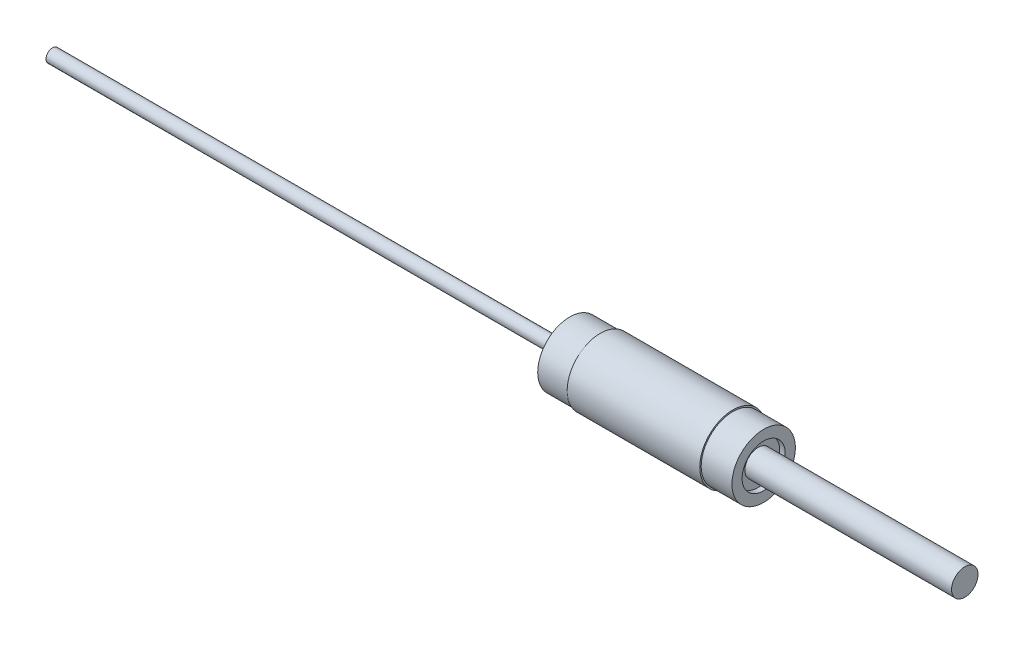
ISO-10303-21;
HEADER;
FILE_DESCRIPTION(('STEP AP214'),'2;1');
FILE_NAME('part.step','',(''),(''),'','','');
FILE_SCHEMA(('AUTOMOTIVE_DESIGN { 1 0 10303 214 1 1 1 1 }'));
ENDSEC;
DATA;
#1=APPLICATION_CONTEXT('core data for automotive mechanical design processes');
#2=APPLICATION_PROTOCOL_DEFINITION('international standard','automotive_design',2000,#1);
#3=PRODUCT_CONTEXT('',#1,'mechanical');
#4=PRODUCT('Part','Part','',(#3));
#5=PRODUCT_RELATED_PRODUCT_CATEGORY('part','',(#4));
#6=PRODUCT_DEFINITION_FORMATION('','',#4);
#7=PRODUCT_DEFINITION_CONTEXT('part definition',#1,'design');
#8=PRODUCT_DEFINITION('design','',#6,#7);
#9=PRODUCT_DEFINITION_SHAPE('','',#8);
#10=(LENGTH_UNIT() NAMED_UNIT(*) SI_UNIT(.MILLI.,.METRE.));
#11=(NAMED_UNIT(*) PLANE_ANGLE_UNIT() SI_UNIT($,.RADIAN.));
#12=(NAMED_UNIT(*) SI_UNIT($,.STERADIAN.) SOLID_ANGLE_UNIT());
#13=UNCERTAINTY_MEASURE_WITH_UNIT(LENGTH_MEASURE(1.E-05),#10,'distance_accuracy_value','');
#14=(GEOMETRIC_REPRESENTATION_CONTEXT(3) GLOBAL_UNCERTAINTY_ASSIGNED_CONTEXT((#13)) GLOBAL_UNIT_ASSIGNED_CONTEXT((#10,
#11,#12)) REPRESENTATION_CONTEXT('',''));
#15=CARTESIAN_POINT('',(0.,0.,0.));
#16=DIRECTION('',(0.,0.,1.));
#17=DIRECTION('',(1.,0.,0.));
#18=AXIS2_PLACEMENT_3D('',#15,#16,#17);
#19=CARTESIAN_POINT('',(0.,3.35,0.));
#20=DIRECTION('',(1.,0.,0.));
#21=DIRECTION('',(0.,0.,-1.));
#22=AXIS2_PLACEMENT_3D('',#19,#20,#21);
#23=PLANE('',#22);
#24=CARTESIAN_POINT('',(0.,0.,0.));
#25=DIRECTION('',(-1.,0.,0.));
#26=DIRECTION('',(0.,0.,1.));
#27=AXIS2_PLACEMENT_3D('',#24,#25,#26);
#28=CIRCLE('',#27,1.59);
#29=CARTESIAN_POINT('',(0.,0.,1.59));
#30=VERTEX_POINT('',#29);
#31=EDGE_CURVE('E70',#30,#30,#28,.T.);
#32=ORIENTED_EDGE('',*,*,#31,.F.);
#33=EDGE_LOOP('',(#32));
#34=FACE_BOUND('',#33,.T.);
#35=CARTESIAN_POINT('',(0.,0.,0.));
#36=DIRECTION('',(-1.,0.,0.));
#37=DIRECTION('',(0.,0.,1.));
#38=AXIS2_PLACEMENT_3D('',#35,#36,#37);
#39=CIRCLE('',#38,7.8);
#40=CARTESIAN_POINT('',(0.,0.,7.8));
#41=VERTEX_POINT('',#40);
#42=EDGE_CURVE('E10',#41,#41,#39,.T.);
#43=ORIENTED_EDGE('',*,*,#42,.T.);
#44=EDGE_LOOP('',(#43));
#45=FACE_BOUND('',#44,.T.);
#46=ADVANCED_FACE('F30',(#34,#45),#23,.F.);
#47=CARTESIAN_POINT('',(-88.99,0.,0.));
#48=DIRECTION('',(-1.,0.,0.));
#49=DIRECTION('',(0.,0.,1.));
#50=AXIS2_PLACEMENT_3D('',#47,#48,#49);
#51=CYLINDRICAL_SURFACE('',#50,7.8);
#52=ORIENTED_EDGE('',*,*,#42,.F.);
#53=EDGE_LOOP('',(#52));
#54=FACE_BOUND('',#53,.T.);
#55=CARTESIAN_POINT('',(7.45,0.,0.));
#56=DIRECTION('',(-1.,0.,0.));
#57=DIRECTION('',(0.,0.,1.));
#58=AXIS2_PLACEMENT_3D('',#55,#56,#57);
#59=CIRCLE('',#58,7.8);
#60=CARTESIAN_POINT('',(7.45,0.,7.8));
#61=VERTEX_POINT('',#60);
#62=EDGE_CURVE('E36',#61,#61,#59,.T.);
#63=ORIENTED_EDGE('',*,*,#62,.T.);
#64=EDGE_LOOP('',(#63));
#65=FACE_BOUND('',#64,.T.);
#66=ADVANCED_FACE('F77',(#54,#65),#51,.T.);
#67=CARTESIAN_POINT('',(7.45,7.8,0.));
#68=DIRECTION('',(1.,0.,0.));
#69=DIRECTION('',(0.,0.,-1.));
#70=AXIS2_PLACEMENT_3D('',#67,#68,#69);
#71=PLANE('',#70);
#72=ORIENTED_EDGE('',*,*,#62,.F.);
#73=EDGE_LOOP('',(#72));
#74=FACE_BOUND('',#73,.T.);
#75=CARTESIAN_POINT('',(7.45,0.,0.));
#76=DIRECTION('',(-1.,0.,0.));
#77=DIRECTION('',(0.,0.,1.));
#78=AXIS2_PLACEMENT_3D('',#75,#76,#77);
#79=CIRCLE('',#78,8.07499999999999);
#80=CARTESIAN_POINT('',(7.45,0.,8.07499999999999));
#81=VERTEX_POINT('',#80);
#82=EDGE_CURVE('E40',#81,#81,#79,.T.);
#83=ORIENTED_EDGE('',*,*,#82,.T.);
#84=EDGE_LOOP('',(#83));
#85=FACE_BOUND('',#84,.T.);
#86=ADVANCED_FACE('F81',(#74,#85),#71,.F.);
#87=CARTESIAN_POINT('',(-88.99,0.,0.));
#88=DIRECTION('',(-1.,0.,0.));
#89=DIRECTION('',(0.,0.,1.));
#90=AXIS2_PLACEMENT_3D('',#87,#88,#89);
#91=CYLINDRICAL_SURFACE('',#90,8.07499999999999);
#92=ORIENTED_EDGE('',*,*,#82,.F.);
#93=EDGE_LOOP('',(#92));
#94=FACE_BOUND('',#93,.T.);
#95=CARTESIAN_POINT('',(39.75,0.,0.));
#96=DIRECTION('',(-1.,0.,0.));
#97=DIRECTION('',(0.,0.,1.));
#98=AXIS2_PLACEMENT_3D('',#95,#96,#97);
#99=CIRCLE('',#98,8.07499999999999);
#100=CARTESIAN_POINT('',(39.75,0.,8.07499999999999));
#101=VERTEX_POINT('',#100);
#102=EDGE_CURVE('E44',#101,#101,#99,.T.);
#103=ORIENTED_EDGE('',*,*,#102,.T.);
#104=EDGE_LOOP('',(#103));
#105=FACE_BOUND('',#104,.T.);
#106=ADVANCED_FACE('F86',(#94,#105),#91,.T.);
#107=CARTESIAN_POINT('',(39.75,8.07499999999999,0.));
#108=DIRECTION('',(-1.,0.,0.));
#109=DIRECTION('',(0.,0.,1.));
#110=AXIS2_PLACEMENT_3D('',#107,#108,#109);
#111=PLANE('',#110);
#112=ORIENTED_EDGE('',*,*,#102,.F.);
#113=EDGE_LOOP('',(#112));
#114=FACE_BOUND('',#113,.T.);
#115=CARTESIAN_POINT('',(39.75,0.,0.));
#116=DIRECTION('',(-1.,0.,0.));
#117=DIRECTION('',(0.,0.,1.));
#118=AXIS2_PLACEMENT_3D('',#115,#116,#117);
#119=CIRCLE('',#118,7.725);
#120=CARTESIAN_POINT('',(39.75,0.,7.725));
#121=VERTEX_POINT('',#120);
#122=EDGE_CURVE('E49',#121,#121,#119,.T.);
#123=ORIENTED_EDGE('',*,*,#122,.T.);
#124=EDGE_LOOP('',(#123));
#125=FACE_BOUND('',#124,.T.);
#126=ADVANCED_FACE('F92',(#114,#125),#111,.F.);
#127=CARTESIAN_POINT('',(-88.99,0.,0.));
#128=DIRECTION('',(-1.,0.,0.));
#129=DIRECTION('',(0.,0.,1.));
#130=AXIS2_PLACEMENT_3D('',#127,#128,#129);
#131=CYLINDRICAL_SURFACE('',#130,7.725);
#132=ORIENTED_EDGE('',*,*,#122,.F.);
#133=EDGE_LOOP('',(#132));
#134=FACE_BOUND('',#133,.T.);
#135=CARTESIAN_POINT('',(47.25,0.,0.));
#136=DIRECTION('',(-1.,0.,0.));
#137=DIRECTION('',(0.,0.,1.));
#138=AXIS2_PLACEMENT_3D('',#135,#136,#137);
#139=CIRCLE('',#138,7.725);
#140=CARTESIAN_POINT('',(47.25,0.,7.725));
#141=VERTEX_POINT('',#140);
#142=EDGE_CURVE('E52',#141,#141,#139,.T.);
#143=ORIENTED_EDGE('',*,*,#142,.T.);
#144=EDGE_LOOP('',(#143));
#145=FACE_BOUND('',#144,.T.);
#146=ADVANCED_FACE('F96',(#134,#145),#131,.T.);
#147=CARTESIAN_POINT('',(47.25,5.25,0.));
#148=DIRECTION('',(-1.,0.,0.));
#149=DIRECTION('',(0.,0.,1.));
#150=AXIS2_PLACEMENT_3D('',#147,#148,#149);
#151=PLANE('',#150);
#152=ORIENTED_EDGE('',*,*,#142,.F.);
#153=EDGE_LOOP('',(#152));
#154=FACE_BOUND('',#153,.T.);
#155=CARTESIAN_POINT('',(47.25,0.,0.));
#156=DIRECTION('',(-1.,0.,0.));
#157=DIRECTION('',(0.,0.,1.));
#158=AXIS2_PLACEMENT_3D('',#155,#156,#157);
#159=CIRCLE('',#158,5.25);
#160=CARTESIAN_POINT('',(47.25,0.,5.25));
#161=VERTEX_POINT('',#160);
#162=EDGE_CURVE('E55',#161,#161,#159,.T.);
#163=ORIENTED_EDGE('',*,*,#162,.T.);
#164=EDGE_LOOP('',(#163));
#165=FACE_BOUND('',#164,.T.);
#166=ADVANCED_FACE('F100',(#154,#165),#151,.F.);
#167=CARTESIAN_POINT('',(-88.99,0.,0.));
#168=DIRECTION('',(-1.,0.,0.));
#169=DIRECTION('',(0.,0.,1.));
#170=AXIS2_PLACEMENT_3D('',#167,#168,#169);
#171=CYLINDRICAL_SURFACE('',#170,5.25);
#172=ORIENTED_EDGE('',*,*,#162,.F.);
#173=EDGE_LOOP('',(#172));
#174=FACE_BOUND('',#173,.T.);
#175=CARTESIAN_POINT('',(45.9,0.,0.));
#176=DIRECTION('',(-1.,0.,0.));
#177=DIRECTION('',(0.,0.,1.));
#178=AXIS2_PLACEMENT_3D('',#175,#176,#177);
#179=CIRCLE('',#178,5.25);
#180=CARTESIAN_POINT('',(45.9,0.,5.25));
#181=VERTEX_POINT('',#180);
#182=EDGE_CURVE('E58',#181,#181,#179,.T.);
#183=ORIENTED_EDGE('',*,*,#182,.T.);
#184=EDGE_LOOP('',(#183));
#185=FACE_BOUND('',#184,.T.);
#186=ADVANCED_FACE('F104',(#174,#185),#171,.F.);
#187=CARTESIAN_POINT('',(45.9,3.22499999999999,0.));
#188=DIRECTION('',(-1.,0.,0.));
#189=DIRECTION('',(0.,0.,1.));
#190=AXIS2_PLACEMENT_3D('',#187,#188,#189);
#191=PLANE('',#190);
#192=ORIENTED_EDGE('',*,*,#182,.F.);
#193=EDGE_LOOP('',(#192));
#194=FACE_BOUND('',#193,.T.);
#195=CARTESIAN_POINT('',(45.9,0.,0.));
#196=DIRECTION('',(-1.,0.,0.));
#197=DIRECTION('',(0.,0.,1.));
#198=AXIS2_PLACEMENT_3D('',#195,#196,#197);
#199=CIRCLE('',#198,3.22499999999999);
#200=CARTESIAN_POINT('',(45.9,0.,3.22499999999999));
#201=VERTEX_POINT('',#200);
#202=EDGE_CURVE('E61',#201,#201,#199,.T.);
#203=ORIENTED_EDGE('',*,*,#202,.T.);
#204=EDGE_LOOP('',(#203));
#205=FACE_BOUND('',#204,.T.);
#206=ADVANCED_FACE('F108',(#194,#205),#191,.F.);
#207=CARTESIAN_POINT('',(-88.99,0.,0.));
#208=DIRECTION('',(-1.,0.,0.));
#209=DIRECTION('',(0.,0.,1.));
#210=AXIS2_PLACEMENT_3D('',#207,#208,#209);
#211=CYLINDRICAL_SURFACE('',#210,3.225);
#212=ORIENTED_EDGE('',*,*,#202,.F.);
#213=EDGE_LOOP('',(#212));
#214=FACE_BOUND('',#213,.T.);
#215=CARTESIAN_POINT('',(96.25,0.,0.));
#216=DIRECTION('',(-1.,0.,0.));
#217=DIRECTION('',(0.,0.,1.));
#218=AXIS2_PLACEMENT_3D('',#215,#216,#217);
#219=CIRCLE('',#218,3.225);
#220=CARTESIAN_POINT('',(96.25,0.,3.225));
#221=VERTEX_POINT('',#220);
#222=EDGE_CURVE('E64',#221,#221,#219,.T.);
#223=ORIENTED_EDGE('',*,*,#222,.T.);
#224=EDGE_LOOP('',(#223));
#225=FACE_BOUND('',#224,.T.);
#226=ADVANCED_FACE('F112',(#214,#225),#211,.T.);
#227=CARTESIAN_POINT('',(96.25,3.225,0.));
#228=DIRECTION('',(-1.,0.,0.));
#229=DIRECTION('',(0.,0.,1.));
#230=AXIS2_PLACEMENT_3D('',#227,#228,#229);
#231=PLANE('',#230);
#232=ORIENTED_EDGE('',*,*,#222,.F.);
#233=EDGE_LOOP('',(#232));
#234=FACE_BOUND('',#233,.T.);
#235=ADVANCED_FACE('F116',(#234),#231,.F.);
#236=CARTESIAN_POINT('',(-126.,0.,0.));
#237=DIRECTION('',(1.,0.,0.));
#238=DIRECTION('',(0.,0.,-1.));
#239=AXIS2_PLACEMENT_3D('',#236,#237,#238);
#240=PLANE('',#239);
#241=CARTESIAN_POINT('',(-126.,0.,0.));
#242=DIRECTION('',(-1.,0.,0.));
#243=DIRECTION('',(0.,0.,1.));
#244=AXIS2_PLACEMENT_3D('',#241,#242,#243);
#245=CIRCLE('',#244,1.58999999999998);
#246=CARTESIAN_POINT('',(-126.,0.,1.58999999999998));
#247=VERTEX_POINT('',#246);
#248=EDGE_CURVE('E67',#247,#247,#245,.T.);
#249=ORIENTED_EDGE('',*,*,#248,.T.);
#250=EDGE_LOOP('',(#249));
#251=FACE_BOUND('',#250,.T.);
#252=ADVANCED_FACE('F120',(#251),#240,.F.);
#253=CARTESIAN_POINT('',(-88.99,0.,0.));
#254=DIRECTION('',(-1.,0.,0.));
#255=DIRECTION('',(0.,0.,1.));
#256=AXIS2_PLACEMENT_3D('',#253,#254,#255);
#257=CYLINDRICAL_SURFACE('',#256,1.58999999999999);
#258=ORIENTED_EDGE('',*,*,#248,.F.);
#259=EDGE_LOOP('',(#258));
#260=FACE_BOUND('',#259,.T.);
#261=ORIENTED_EDGE('',*,*,#31,.T.);
#262=EDGE_LOOP('',(#261));
#263=FACE_BOUND('',#262,.T.);
#264=ADVANCED_FACE('F74',(#260,#263),#257,.T.);
#265=CLOSED_SHELL('',(#46,#66,#86,#106,#126,#146,#166,#186,#206,#226,#235,#252,#264));
#266=MANIFOLD_SOLID_BREP('B2',#265);
#267=ADVANCED_BREP_SHAPE_REPRESENTATION('',(#18,#266),#14);
#268=SHAPE_DEFINITION_REPRESENTATION(#9,#267);
ENDSEC;
END-ISO-10303-21;
